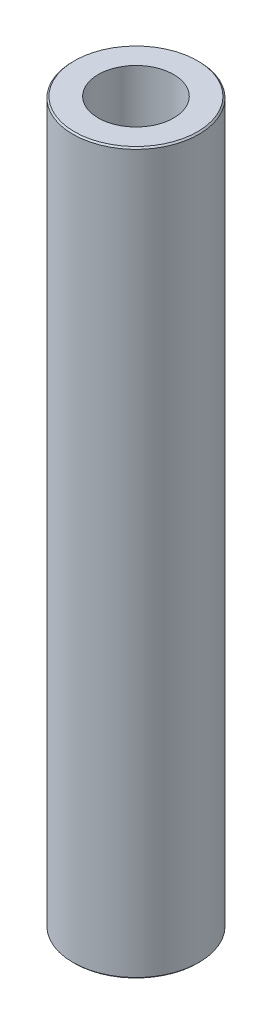
ISO-10303-21;
HEADER;
FILE_DESCRIPTION(('STEP AP214'),'2;1');
FILE_NAME('part.step','',(''),(''),'','','');
FILE_SCHEMA(('AUTOMOTIVE_DESIGN { 1 0 10303 214 1 1 1 1 }'));
ENDSEC;
DATA;
#1=APPLICATION_CONTEXT('core data for automotive mechanical design processes');
#2=APPLICATION_PROTOCOL_DEFINITION('international standard','automotive_design',2000,#1);
#3=PRODUCT_CONTEXT('',#1,'mechanical');
#4=PRODUCT('Part','Part','',(#3));
#5=PRODUCT_RELATED_PRODUCT_CATEGORY('part','',(#4));
#6=PRODUCT_DEFINITION_FORMATION('','',#4);
#7=PRODUCT_DEFINITION_CONTEXT('part definition',#1,'design');
#8=PRODUCT_DEFINITION('design','',#6,#7);
#9=PRODUCT_DEFINITION_SHAPE('','',#8);
#10=(LENGTH_UNIT() NAMED_UNIT(*) SI_UNIT(.MILLI.,.METRE.));
#11=(NAMED_UNIT(*) PLANE_ANGLE_UNIT() SI_UNIT($,.RADIAN.));
#12=(NAMED_UNIT(*) SI_UNIT($,.STERADIAN.) SOLID_ANGLE_UNIT());
#13=UNCERTAINTY_MEASURE_WITH_UNIT(LENGTH_MEASURE(1.E-05),#10,'distance_accuracy_value','');
#14=(GEOMETRIC_REPRESENTATION_CONTEXT(3) GLOBAL_UNCERTAINTY_ASSIGNED_CONTEXT((#13)) GLOBAL_UNIT_ASSIGNED_CONTEXT((#10,
#11,#12)) REPRESENTATION_CONTEXT('',''));
#15=CARTESIAN_POINT('',(0.,0.,0.));
#16=DIRECTION('',(0.,0.,1.));
#17=DIRECTION('',(1.,0.,0.));
#18=AXIS2_PLACEMENT_3D('',#15,#16,#17);
#19=CARTESIAN_POINT('',(0.,600.,0.));
#20=DIRECTION('',(0.,-1.,0.));
#21=DIRECTION('',(0.,0.,-1.));
#22=AXIS2_PLACEMENT_3D('',#19,#20,#21);
#23=CYLINDRICAL_SURFACE('',#22,52.5);
#24=CARTESIAN_POINT('',(0.,598.780943956284,0.));
#25=DIRECTION('',(0.,1.,0.));
#26=DIRECTION('',(0.,0.,1.));
#27=AXIS2_PLACEMENT_3D('',#24,#25,#26);
#28=CIRCLE('',#27,52.5);
#29=CARTESIAN_POINT('',(0.,598.780943956284,52.5));
#30=VERTEX_POINT('',#29);
#31=EDGE_CURVE('E50',#30,#30,#28,.F.);
#32=ORIENTED_EDGE('',*,*,#31,.T.);
#33=EDGE_LOOP('',(#32));
#34=FACE_BOUND('',#33,.T.);
#35=CARTESIAN_POINT('',(0.,1.21905604371642,0.));
#36=DIRECTION('',(0.,1.,0.));
#37=DIRECTION('',(0.,0.,1.));
#38=AXIS2_PLACEMENT_3D('',#35,#36,#37);
#39=CIRCLE('',#38,52.5);
#40=CARTESIAN_POINT('',(0.,1.21905604371642,52.5));
#41=VERTEX_POINT('',#40);
#42=EDGE_CURVE('E51',#41,#41,#39,.T.);
#43=ORIENTED_EDGE('',*,*,#42,.T.);
#44=EDGE_LOOP('',(#43));
#45=FACE_BOUND('',#44,.T.);
#46=ADVANCED_FACE('F39',(#34,#45),#23,.T.);
#47=CARTESIAN_POINT('',(0.,600.,0.));
#48=DIRECTION('',(0.,1.,0.));
#49=DIRECTION('',(0.,0.,1.));
#50=AXIS2_PLACEMENT_3D('',#47,#48,#49);
#51=PLANE('',#50);
#52=CARTESIAN_POINT('',(0.,600.,0.));
#53=DIRECTION('',(0.,1.,0.));
#54=DIRECTION('',(0.,0.,1.));
#55=AXIS2_PLACEMENT_3D('',#52,#53,#54);
#56=CIRCLE('',#55,51.2809439562837);
#57=CARTESIAN_POINT('',(0.,600.,51.2809439562837));
#58=VERTEX_POINT('',#57);
#59=EDGE_CURVE('E54',#58,#58,#56,.T.);
#60=ORIENTED_EDGE('',*,*,#59,.T.);
#61=EDGE_LOOP('',(#60));
#62=FACE_BOUND('',#61,.T.);
#63=CARTESIAN_POINT('',(0.,600.,0.));
#64=DIRECTION('',(0.,1.,0.));
#65=DIRECTION('',(0.,0.,1.));
#66=AXIS2_PLACEMENT_3D('',#63,#64,#65);
#67=CIRCLE('',#66,31.4270897167161);
#68=CARTESIAN_POINT('',(0.,600.,31.4270897167161));
#69=VERTEX_POINT('',#68);
#70=EDGE_CURVE('E58',#69,#69,#67,.T.);
#71=ORIENTED_EDGE('',*,*,#70,.F.);
#72=EDGE_LOOP('',(#71));
#73=FACE_BOUND('',#72,.T.);
#74=ADVANCED_FACE('F69',(#62,#73),#51,.T.);
#75=CARTESIAN_POINT('',(0.,0.,0.));
#76=DIRECTION('',(0.,1.,0.));
#77=DIRECTION('',(0.,0.,1.));
#78=AXIS2_PLACEMENT_3D('',#75,#76,#77);
#79=PLANE('',#78);
#80=CARTESIAN_POINT('',(0.,0.,0.));
#81=DIRECTION('',(0.,1.,0.));
#82=DIRECTION('',(0.,0.,1.));
#83=AXIS2_PLACEMENT_3D('',#80,#81,#82);
#84=CIRCLE('',#83,51.2809439562835);
#85=CARTESIAN_POINT('',(0.,0.,51.2809439562835));
#86=VERTEX_POINT('',#85);
#87=EDGE_CURVE('E10',#86,#86,#84,.F.);
#88=ORIENTED_EDGE('',*,*,#87,.T.);
#89=EDGE_LOOP('',(#88));
#90=FACE_BOUND('',#89,.T.);
#91=CARTESIAN_POINT('',(0.,0.,0.));
#92=DIRECTION('',(0.,1.,0.));
#93=DIRECTION('',(0.,0.,1.));
#94=AXIS2_PLACEMENT_3D('',#91,#92,#93);
#95=CIRCLE('',#94,31.4270897167161);
#96=CARTESIAN_POINT('',(0.,0.,31.4270897167161));
#97=VERTEX_POINT('',#96);
#98=EDGE_CURVE('E63',#97,#97,#95,.T.);
#99=ORIENTED_EDGE('',*,*,#98,.T.);
#100=EDGE_LOOP('',(#99));
#101=FACE_BOUND('',#100,.T.);
#102=ADVANCED_FACE('F75',(#90,#101),#79,.F.);
#103=CARTESIAN_POINT('',(0.,600.,0.));
#104=DIRECTION('',(0.,-1.,0.));
#105=DIRECTION('',(0.,0.,-1.));
#106=AXIS2_PLACEMENT_3D('',#103,#104,#105);
#107=CYLINDRICAL_SURFACE('',#106,31.4270897167161);
#108=ORIENTED_EDGE('',*,*,#70,.T.);
#109=EDGE_LOOP('',(#108));
#110=FACE_BOUND('',#109,.T.);
#111=ORIENTED_EDGE('',*,*,#98,.F.);
#112=EDGE_LOOP('',(#111));
#113=FACE_BOUND('',#112,.T.);
#114=ADVANCED_FACE('F70',(#110,#113),#107,.F.);
#115=CARTESIAN_POINT('',(0.,600.,0.));
#116=DIRECTION('',(0.,-1.,0.));
#117=DIRECTION('',(0.,0.,-1.));
#118=AXIS2_PLACEMENT_3D('',#115,#116,#117);
#119=CONICAL_SURFACE('',#118,51.2809439562837,0.785398163397477);
#120=ORIENTED_EDGE('',*,*,#31,.F.);
#121=EDGE_LOOP('',(#120));
#122=FACE_BOUND('',#121,.T.);
#123=ORIENTED_EDGE('',*,*,#59,.F.);
#124=EDGE_LOOP('',(#123));
#125=FACE_BOUND('',#124,.T.);
#126=ADVANCED_FACE('F81',(#122,#125),#119,.T.);
#127=CARTESIAN_POINT('',(0.,1.21905604371642,0.));
#128=DIRECTION('',(0.,1.,0.));
#129=DIRECTION('',(0.,0.,1.));
#130=AXIS2_PLACEMENT_3D('',#127,#128,#129);
#131=CONICAL_SURFACE('',#130,52.5,0.785398163397474);
#132=ORIENTED_EDGE('',*,*,#87,.F.);
#133=EDGE_LOOP('',(#132));
#134=FACE_BOUND('',#133,.T.);
#135=ORIENTED_EDGE('',*,*,#42,.F.);
#136=EDGE_LOOP('',(#135));
#137=FACE_BOUND('',#136,.T.);
#138=ADVANCED_FACE('F45',(#134,#137),#131,.T.);
#139=CLOSED_SHELL('',(#46,#74,#102,#114,#126,#138));
#140=MANIFOLD_SOLID_BREP('B2',#139);
#141=ADVANCED_BREP_SHAPE_REPRESENTATION('',(#18,#140),#14);
#142=SHAPE_DEFINITION_REPRESENTATION(#9,#141);
ENDSEC;
END-ISO-10303-21;
